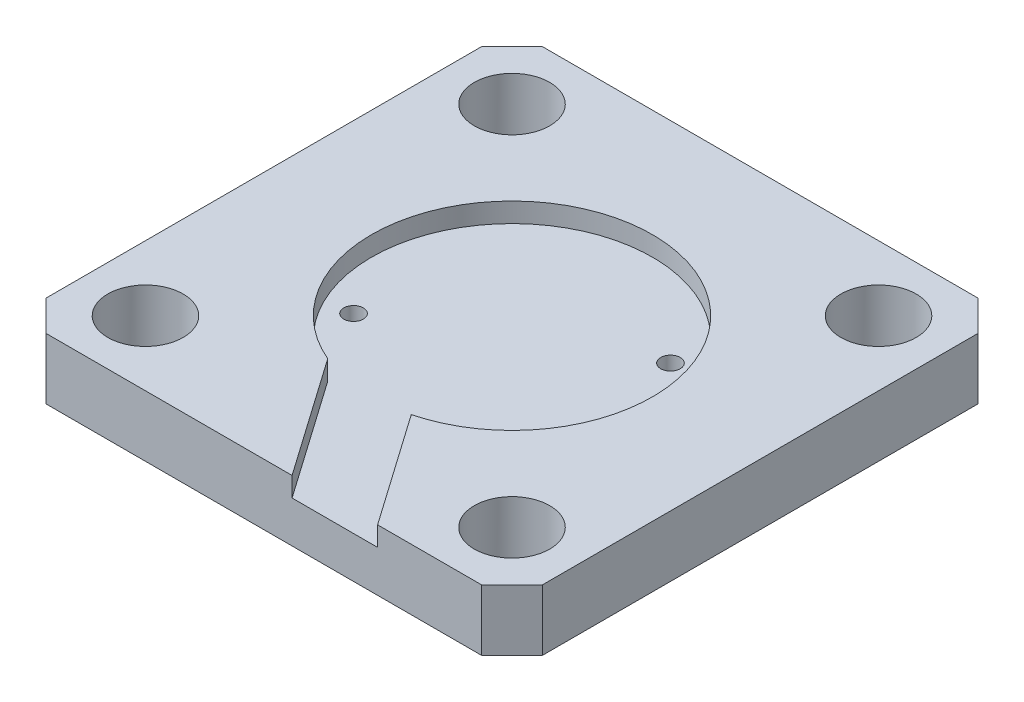
ISO-10303-21;
HEADER;
FILE_DESCRIPTION(('STEP AP214'),'2;1');
FILE_NAME('part.step','',(''),(''),'','','');
FILE_SCHEMA(('AUTOMOTIVE_DESIGN { 1 0 10303 214 1 1 1 1 }'));
ENDSEC;
DATA;
#1=APPLICATION_CONTEXT('core data for automotive mechanical design processes');
#2=APPLICATION_PROTOCOL_DEFINITION('international standard','automotive_design',2000,#1);
#3=PRODUCT_CONTEXT('',#1,'mechanical');
#4=PRODUCT('Part','Part','',(#3));
#5=PRODUCT_RELATED_PRODUCT_CATEGORY('part','',(#4));
#6=PRODUCT_DEFINITION_FORMATION('','',#4);
#7=PRODUCT_DEFINITION_CONTEXT('part definition',#1,'design');
#8=PRODUCT_DEFINITION('design','',#6,#7);
#9=PRODUCT_DEFINITION_SHAPE('','',#8);
#10=(LENGTH_UNIT() NAMED_UNIT(*) SI_UNIT(.MILLI.,.METRE.));
#11=(NAMED_UNIT(*) PLANE_ANGLE_UNIT() SI_UNIT($,.RADIAN.));
#12=(NAMED_UNIT(*) SI_UNIT($,.STERADIAN.) SOLID_ANGLE_UNIT());
#13=UNCERTAINTY_MEASURE_WITH_UNIT(LENGTH_MEASURE(1.E-05),#10,'distance_accuracy_value','');
#14=(GEOMETRIC_REPRESENTATION_CONTEXT(3) GLOBAL_UNCERTAINTY_ASSIGNED_CONTEXT((#13)) GLOBAL_UNIT_ASSIGNED_CONTEXT((#10,
#11,#12)) REPRESENTATION_CONTEXT('',''));
#15=CARTESIAN_POINT('',(0.,0.,0.));
#16=DIRECTION('',(0.,0.,1.));
#17=DIRECTION('',(1.,0.,0.));
#18=AXIS2_PLACEMENT_3D('',#15,#16,#17);
#19=CARTESIAN_POINT('',(-20.32,5.,20.32));
#20=DIRECTION('',(0.,0.,-1.));
#21=DIRECTION('',(-1.,0.,0.));
#22=AXIS2_PLACEMENT_3D('',#19,#20,#21);
#23=PLANE('',#22);
#24=DIRECTION('',(0.,1.,0.));
#25=VECTOR('',#24,1.);
#26=CARTESIAN_POINT('',(2.32,-13.5025136104955,20.32));
#27=LINE('',#26,#25);
#28=CARTESIAN_POINT('',(2.32,3.4,20.32));
#29=VERTEX_POINT('',#28);
#30=CARTESIAN_POINT('',(2.32,5.,20.32));
#31=VERTEX_POINT('',#30);
#32=EDGE_CURVE('E133',#29,#31,#27,.T.);
#33=ORIENTED_EDGE('',*,*,#32,.T.);
#34=DIRECTION('',(1.,0.,0.));
#35=VECTOR('',#34,1.);
#36=CARTESIAN_POINT('',(-20.32,5.,20.32));
#37=LINE('',#36,#35);
#38=CARTESIAN_POINT('',(-17.82,5.,20.32));
#39=VERTEX_POINT('',#38);
#40=EDGE_CURVE('E146',#39,#31,#37,.T.);
#41=ORIENTED_EDGE('',*,*,#40,.F.);
#42=DIRECTION('',(0.,-1.,0.));
#43=VECTOR('',#42,1.);
#44=CARTESIAN_POINT('',(-17.82,5.,20.32));
#45=LINE('',#44,#43);
#46=CARTESIAN_POINT('',(-17.82,0.,20.32));
#47=VERTEX_POINT('',#46);
#48=EDGE_CURVE('E161',#39,#47,#45,.T.);
#49=ORIENTED_EDGE('',*,*,#48,.T.);
#50=DIRECTION('',(1.,0.,0.));
#51=VECTOR('',#50,1.);
#52=CARTESIAN_POINT('',(-20.32,0.,20.32));
#53=LINE('',#52,#51);
#54=CARTESIAN_POINT('',(17.82,0.,20.32));
#55=VERTEX_POINT('',#54);
#56=EDGE_CURVE('E176',#47,#55,#53,.T.);
#57=ORIENTED_EDGE('',*,*,#56,.T.);
#58=DIRECTION('',(0.,1.,0.));
#59=VECTOR('',#58,1.);
#60=CARTESIAN_POINT('',(17.82,5.,20.32));
#61=LINE('',#60,#59);
#62=CARTESIAN_POINT('',(17.82,5.,20.32));
#63=VERTEX_POINT('',#62);
#64=EDGE_CURVE('E157',#55,#63,#61,.T.);
#65=ORIENTED_EDGE('',*,*,#64,.T.);
#66=CARTESIAN_POINT('',(9.32,5.,20.32));
#67=VERTEX_POINT('',#66);
#68=EDGE_CURVE('E158',#67,#63,#37,.T.);
#69=ORIENTED_EDGE('',*,*,#68,.F.);
#70=DIRECTION('',(0.,1.,0.));
#71=VECTOR('',#70,1.);
#72=CARTESIAN_POINT('',(9.32,-13.5025136104955,20.32));
#73=LINE('',#72,#71);
#74=CARTESIAN_POINT('',(9.32,3.39999999999999,20.32));
#75=VERTEX_POINT('',#74);
#76=EDGE_CURVE('E151',#75,#67,#73,.T.);
#77=ORIENTED_EDGE('',*,*,#76,.F.);
#78=DIRECTION('',(-1.,0.,0.));
#79=VECTOR('',#78,1.);
#80=CARTESIAN_POINT('',(0.,3.4,20.32));
#81=LINE('',#80,#79);
#82=EDGE_CURVE('E150',#75,#29,#81,.T.);
#83=ORIENTED_EDGE('',*,*,#82,.T.);
#84=EDGE_LOOP('',(#33,#41,#49,#57,#65,#69,#77,#83));
#85=FACE_BOUND('',#84,.T.);
#86=ADVANCED_FACE('F40',(#85),#23,.F.);
#87=CARTESIAN_POINT('',(0.,5.,0.));
#88=DIRECTION('',(0.,-1.,0.));
#89=DIRECTION('',(0.,0.,-1.));
#90=AXIS2_PLACEMENT_3D('',#87,#88,#89);
#91=PLANE('',#90);
#92=CARTESIAN_POINT('',(-15.,5.,-15.));
#93=DIRECTION('',(0.,1.,0.));
#94=DIRECTION('',(0.,0.,1.));
#95=AXIS2_PLACEMENT_3D('',#92,#93,#94);
#96=CIRCLE('',#95,3.085);
#97=CARTESIAN_POINT('',(-15.,5.,-11.915));
#98=VERTEX_POINT('',#97);
#99=EDGE_CURVE('E171',#98,#98,#96,.T.);
#100=ORIENTED_EDGE('',*,*,#99,.F.);
#101=EDGE_LOOP('',(#100));
#102=FACE_BOUND('',#101,.T.);
#103=CARTESIAN_POINT('',(15.,5.,-15.));
#104=DIRECTION('',(0.,1.,0.));
#105=DIRECTION('',(0.,0.,1.));
#106=AXIS2_PLACEMENT_3D('',#103,#104,#105);
#107=CIRCLE('',#106,3.085);
#108=CARTESIAN_POINT('',(15.,5.,-11.915));
#109=VERTEX_POINT('',#108);
#110=EDGE_CURVE('E246',#109,#109,#107,.T.);
#111=ORIENTED_EDGE('',*,*,#110,.F.);
#112=EDGE_LOOP('',(#111));
#113=FACE_BOUND('',#112,.T.);
#114=CARTESIAN_POINT('',(15.0000000000003,5.,15.));
#115=DIRECTION('',(0.,1.,0.));
#116=DIRECTION('',(0.,0.,1.));
#117=AXIS2_PLACEMENT_3D('',#114,#115,#116);
#118=CIRCLE('',#117,3.085);
#119=CARTESIAN_POINT('',(15.0000000000003,5.,18.085));
#120=VERTEX_POINT('',#119);
#121=EDGE_CURVE('E240',#120,#120,#118,.T.);
#122=ORIENTED_EDGE('',*,*,#121,.F.);
#123=EDGE_LOOP('',(#122));
#124=FACE_BOUND('',#123,.T.);
#125=CARTESIAN_POINT('',(-14.9999999999997,5.,15.));
#126=DIRECTION('',(0.,1.,0.));
#127=DIRECTION('',(0.,0.,1.));
#128=AXIS2_PLACEMENT_3D('',#125,#126,#127);
#129=CIRCLE('',#128,3.085);
#130=CARTESIAN_POINT('',(-14.9999999999997,5.,18.085));
#131=VERTEX_POINT('',#130);
#132=EDGE_CURVE('E233',#131,#131,#129,.T.);
#133=ORIENTED_EDGE('',*,*,#132,.F.);
#134=EDGE_LOOP('',(#133));
#135=FACE_BOUND('',#134,.T.);
#136=DIRECTION('',(-0.57357643635105,0.,-0.819152044288989));
#137=VECTOR('',#136,1.);
#138=CARTESIAN_POINT('',(-7.9905336609271,5.,5.59503190369964));
#139=LINE('',#138,#137);
#140=CARTESIAN_POINT('',(-4.49703455270138,5.,10.5842656916675));
#141=VERTEX_POINT('',#140);
#142=EDGE_CURVE('E130',#31,#141,#139,.T.);
#143=ORIENTED_EDGE('',*,*,#142,.T.);
#144=CARTESIAN_POINT('',(0.,5.,0.));
#145=DIRECTION('',(0.,1.,0.));
#146=DIRECTION('',(0.,0.,1.));
#147=AXIS2_PLACEMENT_3D('',#144,#145,#146);
#148=CIRCLE('',#147,11.5);
#149=CARTESIAN_POINT('',(2.8864061885103,5.,11.1318758219327));
#150=VERTEX_POINT('',#149);
#151=EDGE_CURVE('E251',#150,#141,#148,.T.);
#152=ORIENTED_EDGE('',*,*,#151,.F.);
#153=DIRECTION('',(-0.57357643635105,0.,-0.819152044288989));
#154=VECTOR('',#153,1.);
#155=CARTESIAN_POINT('',(-3.29346315928729,5.,2.30610773094895));
#156=LINE('',#155,#154);
#157=EDGE_CURVE('E141',#67,#150,#156,.T.);
#158=ORIENTED_EDGE('',*,*,#157,.F.);
#159=ORIENTED_EDGE('',*,*,#68,.T.);
#160=DIRECTION('',(-0.70710678118655,0.,0.707106781186546));
#161=VECTOR('',#160,1.);
#162=CARTESIAN_POINT('',(20.32,5.,17.82));
#163=LINE('',#162,#161);
#164=CARTESIAN_POINT('',(20.32,5.,17.82));
#165=VERTEX_POINT('',#164);
#166=EDGE_CURVE('E198',#63,#165,#163,.F.);
#167=ORIENTED_EDGE('',*,*,#166,.T.);
#168=DIRECTION('',(0.,0.,-1.));
#169=VECTOR('',#168,1.);
#170=CARTESIAN_POINT('',(20.32,5.,20.32));
#171=LINE('',#170,#169);
#172=CARTESIAN_POINT('',(20.32,5.,-17.82));
#173=VERTEX_POINT('',#172);
#174=EDGE_CURVE('E178',#165,#173,#171,.T.);
#175=ORIENTED_EDGE('',*,*,#174,.T.);
#176=DIRECTION('',(0.707106781186547,0.,0.707106781186548));
#177=VECTOR('',#176,1.);
#178=CARTESIAN_POINT('',(17.82,5.,-20.32));
#179=LINE('',#178,#177);
#180=CARTESIAN_POINT('',(17.82,5.,-20.32));
#181=VERTEX_POINT('',#180);
#182=EDGE_CURVE('E196',#173,#181,#179,.F.);
#183=ORIENTED_EDGE('',*,*,#182,.T.);
#184=DIRECTION('',(-1.,0.,0.));
#185=VECTOR('',#184,1.);
#186=CARTESIAN_POINT('',(-20.32,5.,-20.32));
#187=LINE('',#186,#185);
#188=CARTESIAN_POINT('',(-17.82,5.,-20.32));
#189=VERTEX_POINT('',#188);
#190=EDGE_CURVE('E223',#181,#189,#187,.T.);
#191=ORIENTED_EDGE('',*,*,#190,.T.);
#192=DIRECTION('',(0.707106781186548,0.,-0.707106781186547));
#193=VECTOR('',#192,1.);
#194=CARTESIAN_POINT('',(-20.32,5.,-17.82));
#195=LINE('',#194,#193);
#196=CARTESIAN_POINT('',(-20.32,5.,-17.82));
#197=VERTEX_POINT('',#196);
#198=EDGE_CURVE('E194',#189,#197,#195,.F.);
#199=ORIENTED_EDGE('',*,*,#198,.T.);
#200=DIRECTION('',(0.,0.,1.));
#201=VECTOR('',#200,1.);
#202=CARTESIAN_POINT('',(-20.32,5.,20.32));
#203=LINE('',#202,#201);
#204=CARTESIAN_POINT('',(-20.32,5.,17.82));
#205=VERTEX_POINT('',#204);
#206=EDGE_CURVE('E163',#197,#205,#203,.T.);
#207=ORIENTED_EDGE('',*,*,#206,.T.);
#208=DIRECTION('',(-0.707106781186546,0.,-0.70710678118655));
#209=VECTOR('',#208,1.);
#210=CARTESIAN_POINT('',(-17.82,5.,20.32));
#211=LINE('',#210,#209);
#212=EDGE_CURVE('E156',#205,#39,#211,.F.);
#213=ORIENTED_EDGE('',*,*,#212,.T.);
#214=ORIENTED_EDGE('',*,*,#40,.T.);
#215=EDGE_LOOP('',(#143,#152,#158,#159,#167,#175,#183,#191,#199,#207,#213,#214));
#216=FACE_BOUND('',#215,.T.);
#217=ADVANCED_FACE('F153',(#102,#113,#124,#135,#216),#91,.F.);
#218=CARTESIAN_POINT('',(0.,3.4,0.));
#219=DIRECTION('',(0.,1.,0.));
#220=DIRECTION('',(0.,0.,1.));
#221=AXIS2_PLACEMENT_3D('',#218,#219,#220);
#222=CYLINDRICAL_SURFACE('',#221,11.5);
#223=DIRECTION('',(0.,1.,0.));
#224=VECTOR('',#223,1.);
#225=CARTESIAN_POINT('',(-4.49703455270138,-13.5025136104955,10.5842656916675));
#226=LINE('',#225,#224);
#227=CARTESIAN_POINT('',(-4.49703455270138,3.4,10.5842656916675));
#228=VERTEX_POINT('',#227);
#229=EDGE_CURVE('E136',#228,#141,#226,.T.);
#230=ORIENTED_EDGE('',*,*,#229,.F.);
#231=CARTESIAN_POINT('',(0.,3.4,0.));
#232=DIRECTION('',(0.,1.,0.));
#233=DIRECTION('',(0.,0.,1.));
#234=AXIS2_PLACEMENT_3D('',#231,#232,#233);
#235=CIRCLE('',#234,11.5);
#236=CARTESIAN_POINT('',(2.8864061885103,3.4,11.1318758219327));
#237=VERTEX_POINT('',#236);
#238=EDGE_CURVE('E237',#237,#228,#235,.T.);
#239=ORIENTED_EDGE('',*,*,#238,.F.);
#240=DIRECTION('',(0.,1.,0.));
#241=VECTOR('',#240,1.);
#242=CARTESIAN_POINT('',(2.8864061885103,-13.5025136104955,11.1318758219327));
#243=LINE('',#242,#241);
#244=EDGE_CURVE('E55',#237,#150,#243,.T.);
#245=ORIENTED_EDGE('',*,*,#244,.T.);
#246=ORIENTED_EDGE('',*,*,#151,.T.);
#247=EDGE_LOOP('',(#230,#239,#245,#246));
#248=FACE_BOUND('',#247,.T.);
#249=ADVANCED_FACE('F283',(#248),#222,.F.);
#250=CARTESIAN_POINT('',(20.32,5.,20.32));
#251=DIRECTION('',(-1.,0.,0.));
#252=DIRECTION('',(0.,0.,1.));
#253=AXIS2_PLACEMENT_3D('',#250,#251,#252);
#254=PLANE('',#253);
#255=ORIENTED_EDGE('',*,*,#174,.F.);
#256=DIRECTION('',(0.,-1.,0.));
#257=VECTOR('',#256,1.);
#258=CARTESIAN_POINT('',(20.32,5.,17.82));
#259=LINE('',#258,#257);
#260=CARTESIAN_POINT('',(20.32,0.,17.82));
#261=VERTEX_POINT('',#260);
#262=EDGE_CURVE('E203',#165,#261,#259,.T.);
#263=ORIENTED_EDGE('',*,*,#262,.T.);
#264=DIRECTION('',(0.,0.,-1.));
#265=VECTOR('',#264,1.);
#266=CARTESIAN_POINT('',(20.32,0.,20.32));
#267=LINE('',#266,#265);
#268=CARTESIAN_POINT('',(20.32,0.,-17.82));
#269=VERTEX_POINT('',#268);
#270=EDGE_CURVE('E167',#261,#269,#267,.T.);
#271=ORIENTED_EDGE('',*,*,#270,.T.);
#272=DIRECTION('',(0.,1.,0.));
#273=VECTOR('',#272,1.);
#274=CARTESIAN_POINT('',(20.32,5.,-17.82));
#275=LINE('',#274,#273);
#276=EDGE_CURVE('E201',#269,#173,#275,.T.);
#277=ORIENTED_EDGE('',*,*,#276,.T.);
#278=EDGE_LOOP('',(#255,#263,#271,#277));
#279=FACE_BOUND('',#278,.T.);
#280=ADVANCED_FACE('F209',(#279),#254,.F.);
#281=CARTESIAN_POINT('',(-20.32,5.,-20.32));
#282=DIRECTION('',(0.,0.,1.));
#283=DIRECTION('',(1.,0.,0.));
#284=AXIS2_PLACEMENT_3D('',#281,#282,#283);
#285=PLANE('',#284);
#286=ORIENTED_EDGE('',*,*,#190,.F.);
#287=DIRECTION('',(0.,-1.,0.));
#288=VECTOR('',#287,1.);
#289=CARTESIAN_POINT('',(17.82,5.,-20.32));
#290=LINE('',#289,#288);
#291=CARTESIAN_POINT('',(17.82,0.,-20.32));
#292=VERTEX_POINT('',#291);
#293=EDGE_CURVE('E12',#181,#292,#290,.T.);
#294=ORIENTED_EDGE('',*,*,#293,.T.);
#295=DIRECTION('',(-1.,0.,0.));
#296=VECTOR('',#295,1.);
#297=CARTESIAN_POINT('',(-20.32,0.,-20.32));
#298=LINE('',#297,#296);
#299=CARTESIAN_POINT('',(-17.82,0.,-20.32));
#300=VERTEX_POINT('',#299);
#301=EDGE_CURVE('E170',#292,#300,#298,.T.);
#302=ORIENTED_EDGE('',*,*,#301,.T.);
#303=DIRECTION('',(0.,1.,0.));
#304=VECTOR('',#303,1.);
#305=CARTESIAN_POINT('',(-17.82,5.,-20.32));
#306=LINE('',#305,#304);
#307=EDGE_CURVE('E48',#300,#189,#306,.T.);
#308=ORIENTED_EDGE('',*,*,#307,.T.);
#309=EDGE_LOOP('',(#286,#294,#302,#308));
#310=FACE_BOUND('',#309,.T.);
#311=ADVANCED_FACE('F222',(#310),#285,.F.);
#312=CARTESIAN_POINT('',(-20.32,5.,20.32));
#313=DIRECTION('',(1.,0.,0.));
#314=DIRECTION('',(0.,0.,-1.));
#315=AXIS2_PLACEMENT_3D('',#312,#313,#314);
#316=PLANE('',#315);
#317=DIRECTION('',(0.,0.,1.));
#318=VECTOR('',#317,1.);
#319=CARTESIAN_POINT('',(-20.32,0.,20.32));
#320=LINE('',#319,#318);
#321=CARTESIAN_POINT('',(-20.32,0.,-17.82));
#322=VERTEX_POINT('',#321);
#323=CARTESIAN_POINT('',(-20.32,0.,17.82));
#324=VERTEX_POINT('',#323);
#325=EDGE_CURVE('E173',#322,#324,#320,.T.);
#326=ORIENTED_EDGE('',*,*,#325,.T.);
#327=DIRECTION('',(0.,1.,0.));
#328=VECTOR('',#327,1.);
#329=CARTESIAN_POINT('',(-20.32,5.,17.82));
#330=LINE('',#329,#328);
#331=EDGE_CURVE('E192',#324,#205,#330,.T.);
#332=ORIENTED_EDGE('',*,*,#331,.T.);
#333=ORIENTED_EDGE('',*,*,#206,.F.);
#334=DIRECTION('',(0.,-1.,0.));
#335=VECTOR('',#334,1.);
#336=CARTESIAN_POINT('',(-20.32,5.,-17.82));
#337=LINE('',#336,#335);
#338=EDGE_CURVE('E189',#197,#322,#337,.T.);
#339=ORIENTED_EDGE('',*,*,#338,.T.);
#340=EDGE_LOOP('',(#326,#332,#333,#339));
#341=FACE_BOUND('',#340,.T.);
#342=ADVANCED_FACE('F301',(#341),#316,.F.);
#343=CARTESIAN_POINT('',(0.,0.,0.));
#344=DIRECTION('',(0.,-1.,0.));
#345=DIRECTION('',(0.,0.,-1.));
#346=AXIS2_PLACEMENT_3D('',#343,#344,#345);
#347=PLANE('',#346);
#348=CARTESIAN_POINT('',(-8.24305369582557,0.,4.72730916659133));
#349=DIRECTION('',(0.,1.,0.));
#350=DIRECTION('',(0.,0.,1.));
#351=AXIS2_PLACEMENT_3D('',#348,#349,#350);
#352=CIRCLE('',#351,0.800000000000001);
#353=CARTESIAN_POINT('',(-8.24305369582557,0.,5.52730916659133));
#354=VERTEX_POINT('',#353);
#355=EDGE_CURVE('E253',#354,#354,#352,.T.);
#356=ORIENTED_EDGE('',*,*,#355,.T.);
#357=EDGE_LOOP('',(#356));
#358=FACE_BOUND('',#357,.T.);
#359=CARTESIAN_POINT('',(8.24305369582557,0.,-4.72730916659133));
#360=DIRECTION('',(0.,1.,0.));
#361=DIRECTION('',(0.,0.,1.));
#362=AXIS2_PLACEMENT_3D('',#359,#360,#361);
#363=CIRCLE('',#362,0.800000000000001);
#364=CARTESIAN_POINT('',(8.24305369582557,0.,-3.92730916659133));
#365=VERTEX_POINT('',#364);
#366=EDGE_CURVE('E256',#365,#365,#363,.T.);
#367=ORIENTED_EDGE('',*,*,#366,.T.);
#368=EDGE_LOOP('',(#367));
#369=FACE_BOUND('',#368,.T.);
#370=CARTESIAN_POINT('',(-14.9999999999997,0.,15.));
#371=DIRECTION('',(0.,-1.,0.));
#372=DIRECTION('',(0.,0.,-1.));
#373=AXIS2_PLACEMENT_3D('',#370,#371,#372);
#374=CIRCLE('',#373,3.085);
#375=CARTESIAN_POINT('',(-14.9999999999997,0.,11.915));
#376=VERTEX_POINT('',#375);
#377=EDGE_CURVE('E236',#376,#376,#374,.F.);
#378=ORIENTED_EDGE('',*,*,#377,.T.);
#379=EDGE_LOOP('',(#378));
#380=FACE_BOUND('',#379,.T.);
#381=CARTESIAN_POINT('',(15.0000000000003,0.,15.));
#382=DIRECTION('',(0.,-1.,0.));
#383=DIRECTION('',(0.,0.,-1.));
#384=AXIS2_PLACEMENT_3D('',#381,#382,#383);
#385=CIRCLE('',#384,3.085);
#386=CARTESIAN_POINT('',(15.0000000000003,0.,11.915));
#387=VERTEX_POINT('',#386);
#388=EDGE_CURVE('E243',#387,#387,#385,.F.);
#389=ORIENTED_EDGE('',*,*,#388,.T.);
#390=EDGE_LOOP('',(#389));
#391=FACE_BOUND('',#390,.T.);
#392=CARTESIAN_POINT('',(15.,0.,-15.));
#393=DIRECTION('',(0.,-1.,0.));
#394=DIRECTION('',(0.,0.,-1.));
#395=AXIS2_PLACEMENT_3D('',#392,#393,#394);
#396=CIRCLE('',#395,3.085);
#397=CARTESIAN_POINT('',(15.,0.,-18.085));
#398=VERTEX_POINT('',#397);
#399=EDGE_CURVE('E230',#398,#398,#396,.F.);
#400=ORIENTED_EDGE('',*,*,#399,.T.);
#401=EDGE_LOOP('',(#400));
#402=FACE_BOUND('',#401,.T.);
#403=CARTESIAN_POINT('',(-15.,0.,-15.));
#404=DIRECTION('',(0.,-1.,0.));
#405=DIRECTION('',(0.,0.,-1.));
#406=AXIS2_PLACEMENT_3D('',#403,#404,#405);
#407=CIRCLE('',#406,3.085);
#408=CARTESIAN_POINT('',(-15.,0.,-18.085));
#409=VERTEX_POINT('',#408);
#410=EDGE_CURVE('E227',#409,#409,#407,.F.);
#411=ORIENTED_EDGE('',*,*,#410,.T.);
#412=EDGE_LOOP('',(#411));
#413=FACE_BOUND('',#412,.T.);
#414=ORIENTED_EDGE('',*,*,#56,.F.);
#415=DIRECTION('',(0.707106781186546,0.,0.70710678118655));
#416=VECTOR('',#415,1.);
#417=CARTESIAN_POINT('',(-19.0700000000001,0.,19.07));
#418=LINE('',#417,#416);
#419=EDGE_CURVE('E187',#47,#324,#418,.F.);
#420=ORIENTED_EDGE('',*,*,#419,.T.);
#421=ORIENTED_EDGE('',*,*,#325,.F.);
#422=DIRECTION('',(-0.707106781186548,0.,0.707106781186547));
#423=VECTOR('',#422,1.);
#424=CARTESIAN_POINT('',(-19.07,0.,-19.07));
#425=LINE('',#424,#423);
#426=EDGE_CURVE('E181',#322,#300,#425,.F.);
#427=ORIENTED_EDGE('',*,*,#426,.T.);
#428=ORIENTED_EDGE('',*,*,#301,.F.);
#429=DIRECTION('',(-0.707106781186547,0.,-0.707106781186548));
#430=VECTOR('',#429,1.);
#431=CARTESIAN_POINT('',(19.07,0.,-19.07));
#432=LINE('',#431,#430);
#433=EDGE_CURVE('E183',#292,#269,#432,.F.);
#434=ORIENTED_EDGE('',*,*,#433,.T.);
#435=ORIENTED_EDGE('',*,*,#270,.F.);
#436=DIRECTION('',(0.70710678118655,0.,-0.707106781186546));
#437=VECTOR('',#436,1.);
#438=CARTESIAN_POINT('',(19.0699999999999,0.,19.0700000000001));
#439=LINE('',#438,#437);
#440=EDGE_CURVE('E185',#261,#55,#439,.F.);
#441=ORIENTED_EDGE('',*,*,#440,.T.);
#442=EDGE_LOOP('',(#414,#420,#421,#427,#428,#434,#435,#441));
#443=FACE_BOUND('',#442,.T.);
#444=ADVANCED_FACE('F216',(#358,#369,#380,#391,#402,#413,#443),#347,.T.);
#445=CARTESIAN_POINT('',(-15.,-0.00100000000000013,-15.));
#446=DIRECTION('',(0.,1.,0.));
#447=DIRECTION('',(0.,0.,1.));
#448=AXIS2_PLACEMENT_3D('',#445,#446,#447);
#449=CYLINDRICAL_SURFACE('',#448,3.085);
#450=ORIENTED_EDGE('',*,*,#410,.F.);
#451=EDGE_LOOP('',(#450));
#452=FACE_BOUND('',#451,.T.);
#453=ORIENTED_EDGE('',*,*,#99,.T.);
#454=EDGE_LOOP('',(#453));
#455=FACE_BOUND('',#454,.T.);
#456=ADVANCED_FACE('F366',(#452,#455),#449,.F.);
#457=CARTESIAN_POINT('',(15.,-0.00100000000000013,-15.));
#458=DIRECTION('',(0.,1.,0.));
#459=DIRECTION('',(0.,0.,1.));
#460=AXIS2_PLACEMENT_3D('',#457,#458,#459);
#461=CYLINDRICAL_SURFACE('',#460,3.085);
#462=ORIENTED_EDGE('',*,*,#399,.F.);
#463=EDGE_LOOP('',(#462));
#464=FACE_BOUND('',#463,.T.);
#465=ORIENTED_EDGE('',*,*,#110,.T.);
#466=EDGE_LOOP('',(#465));
#467=FACE_BOUND('',#466,.T.);
#468=ADVANCED_FACE('F427',(#464,#467),#461,.F.);
#469=CARTESIAN_POINT('',(15.0000000000003,-0.00100000000000013,15.));
#470=DIRECTION('',(0.,1.,0.));
#471=DIRECTION('',(0.,0.,1.));
#472=AXIS2_PLACEMENT_3D('',#469,#470,#471);
#473=CYLINDRICAL_SURFACE('',#472,3.085);
#474=ORIENTED_EDGE('',*,*,#388,.F.);
#475=EDGE_LOOP('',(#474));
#476=FACE_BOUND('',#475,.T.);
#477=ORIENTED_EDGE('',*,*,#121,.T.);
#478=EDGE_LOOP('',(#477));
#479=FACE_BOUND('',#478,.T.);
#480=ADVANCED_FACE('F417',(#476,#479),#473,.F.);
#481=CARTESIAN_POINT('',(-14.9999999999997,-0.00100000000000013,15.));
#482=DIRECTION('',(0.,1.,0.));
#483=DIRECTION('',(0.,0.,1.));
#484=AXIS2_PLACEMENT_3D('',#481,#482,#483);
#485=CYLINDRICAL_SURFACE('',#484,3.085);
#486=ORIENTED_EDGE('',*,*,#377,.F.);
#487=EDGE_LOOP('',(#486));
#488=FACE_BOUND('',#487,.T.);
#489=ORIENTED_EDGE('',*,*,#132,.T.);
#490=EDGE_LOOP('',(#489));
#491=FACE_BOUND('',#490,.T.);
#492=ADVANCED_FACE('F311',(#488,#491),#485,.F.);
#493=CARTESIAN_POINT('',(-17.82,5.,20.32));
#494=DIRECTION('',(0.707106781186549,0.,-0.707106781186545));
#495=DIRECTION('',(0.,-1.,0.));
#496=AXIS2_PLACEMENT_3D('',#493,#494,#495);
#497=PLANE('',#496);
#498=ORIENTED_EDGE('',*,*,#212,.F.);
#499=ORIENTED_EDGE('',*,*,#331,.F.);
#500=ORIENTED_EDGE('',*,*,#419,.F.);
#501=ORIENTED_EDGE('',*,*,#48,.F.);
#502=EDGE_LOOP('',(#498,#499,#500,#501));
#503=FACE_BOUND('',#502,.T.);
#504=ADVANCED_FACE('F307',(#503),#497,.F.);
#505=CARTESIAN_POINT('',(20.32,5.,17.82));
#506=DIRECTION('',(-0.707106781186545,0.,-0.707106781186549));
#507=DIRECTION('',(0.,-1.,0.));
#508=AXIS2_PLACEMENT_3D('',#505,#506,#507);
#509=PLANE('',#508);
#510=ORIENTED_EDGE('',*,*,#166,.F.);
#511=ORIENTED_EDGE('',*,*,#64,.F.);
#512=ORIENTED_EDGE('',*,*,#440,.F.);
#513=ORIENTED_EDGE('',*,*,#262,.F.);
#514=EDGE_LOOP('',(#510,#511,#512,#513));
#515=FACE_BOUND('',#514,.T.);
#516=ADVANCED_FACE('F310',(#515),#509,.F.);
#517=CARTESIAN_POINT('',(17.82,5.,-20.32));
#518=DIRECTION('',(-0.707106781186548,0.,0.707106781186547));
#519=DIRECTION('',(0.,-1.,0.));
#520=AXIS2_PLACEMENT_3D('',#517,#518,#519);
#521=PLANE('',#520);
#522=ORIENTED_EDGE('',*,*,#182,.F.);
#523=ORIENTED_EDGE('',*,*,#276,.F.);
#524=ORIENTED_EDGE('',*,*,#433,.F.);
#525=ORIENTED_EDGE('',*,*,#293,.F.);
#526=EDGE_LOOP('',(#522,#523,#524,#525));
#527=FACE_BOUND('',#526,.T.);
#528=ADVANCED_FACE('F221',(#527),#521,.F.);
#529=CARTESIAN_POINT('',(-20.32,5.,-17.82));
#530=DIRECTION('',(0.707106781186547,0.,0.707106781186548));
#531=DIRECTION('',(0.,-1.,0.));
#532=AXIS2_PLACEMENT_3D('',#529,#530,#531);
#533=PLANE('',#532);
#534=ORIENTED_EDGE('',*,*,#198,.F.);
#535=ORIENTED_EDGE('',*,*,#307,.F.);
#536=ORIENTED_EDGE('',*,*,#426,.F.);
#537=ORIENTED_EDGE('',*,*,#338,.F.);
#538=EDGE_LOOP('',(#534,#535,#536,#537));
#539=FACE_BOUND('',#538,.T.);
#540=ADVANCED_FACE('F42',(#539),#533,.F.);
#541=CARTESIAN_POINT('',(0.,3.4,0.));
#542=DIRECTION('',(0.,1.,0.));
#543=DIRECTION('',(0.,0.,1.));
#544=AXIS2_PLACEMENT_3D('',#541,#542,#543);
#545=PLANE('',#544);
#546=CARTESIAN_POINT('',(-8.24305369582557,3.4,4.72730916659133));
#547=DIRECTION('',(0.,1.,0.));
#548=DIRECTION('',(0.,0.,1.));
#549=AXIS2_PLACEMENT_3D('',#546,#547,#548);
#550=CIRCLE('',#549,0.800000000000001);
#551=CARTESIAN_POINT('',(-8.24305369582557,3.4,5.52730916659133));
#552=VERTEX_POINT('',#551);
#553=EDGE_CURVE('E262',#552,#552,#550,.T.);
#554=ORIENTED_EDGE('',*,*,#553,.F.);
#555=EDGE_LOOP('',(#554));
#556=FACE_BOUND('',#555,.T.);
#557=CARTESIAN_POINT('',(8.24305369582557,3.4,-4.72730916659133));
#558=DIRECTION('',(0.,1.,0.));
#559=DIRECTION('',(0.,0.,1.));
#560=AXIS2_PLACEMENT_3D('',#557,#558,#559);
#561=CIRCLE('',#560,0.800000000000001);
#562=CARTESIAN_POINT('',(8.24305369582557,3.4,-3.92730916659133));
#563=VERTEX_POINT('',#562);
#564=EDGE_CURVE('E259',#563,#563,#561,.T.);
#565=ORIENTED_EDGE('',*,*,#564,.F.);
#566=EDGE_LOOP('',(#565));
#567=FACE_BOUND('',#566,.T.);
#568=ORIENTED_EDGE('',*,*,#238,.T.);
#569=DIRECTION('',(0.57357643635105,0.,0.819152044288989));
#570=VECTOR('',#569,1.);
#571=CARTESIAN_POINT('',(-7.9905336609271,3.4,5.59503190369964));
#572=LINE('',#571,#570);
#573=EDGE_CURVE('E267',#228,#29,#572,.T.);
#574=ORIENTED_EDGE('',*,*,#573,.T.);
#575=ORIENTED_EDGE('',*,*,#82,.F.);
#576=DIRECTION('',(0.57357643635105,0.,0.819152044288989));
#577=VECTOR('',#576,1.);
#578=CARTESIAN_POINT('',(-3.29346315928729,3.4,2.30610773094895));
#579=LINE('',#578,#577);
#580=EDGE_CURVE('E272',#237,#75,#579,.T.);
#581=ORIENTED_EDGE('',*,*,#580,.F.);
#582=EDGE_LOOP('',(#568,#574,#575,#581));
#583=FACE_BOUND('',#582,.T.);
#584=ADVANCED_FACE('F279',(#556,#567,#583),#545,.T.);
#585=CARTESIAN_POINT('',(8.24305369582557,0.,-4.72730916659133));
#586=DIRECTION('',(0.,1.,0.));
#587=DIRECTION('',(0.,0.,1.));
#588=AXIS2_PLACEMENT_3D('',#585,#586,#587);
#589=CYLINDRICAL_SURFACE('',#588,0.800000000000001);
#590=ORIENTED_EDGE('',*,*,#366,.F.);
#591=EDGE_LOOP('',(#590));
#592=FACE_BOUND('',#591,.T.);
#593=ORIENTED_EDGE('',*,*,#564,.T.);
#594=EDGE_LOOP('',(#593));
#595=FACE_BOUND('',#594,.T.);
#596=ADVANCED_FACE('F322',(#592,#595),#589,.F.);
#597=CARTESIAN_POINT('',(-8.24305369582557,0.,4.72730916659133));
#598=DIRECTION('',(0.,1.,0.));
#599=DIRECTION('',(0.,0.,1.));
#600=AXIS2_PLACEMENT_3D('',#597,#598,#599);
#601=CYLINDRICAL_SURFACE('',#600,0.800000000000001);
#602=ORIENTED_EDGE('',*,*,#355,.F.);
#603=EDGE_LOOP('',(#602));
#604=FACE_BOUND('',#603,.T.);
#605=ORIENTED_EDGE('',*,*,#553,.T.);
#606=EDGE_LOOP('',(#605));
#607=FACE_BOUND('',#606,.T.);
#608=ADVANCED_FACE('F331',(#604,#607),#601,.F.);
#609=CARTESIAN_POINT('',(-7.9905336609271,-13.5025136104955,5.59503190369964));
#610=DIRECTION('',(0.819152044288989,0.,-0.57357643635105));
#611=DIRECTION('',(-0.57357643635105,0.,-0.819152044288989));
#612=AXIS2_PLACEMENT_3D('',#609,#610,#611);
#613=PLANE('',#612);
#614=ORIENTED_EDGE('',*,*,#229,.T.);
#615=ORIENTED_EDGE('',*,*,#142,.F.);
#616=ORIENTED_EDGE('',*,*,#32,.F.);
#617=ORIENTED_EDGE('',*,*,#573,.F.);
#618=EDGE_LOOP('',(#614,#615,#616,#617));
#619=FACE_BOUND('',#618,.T.);
#620=ADVANCED_FACE('F132',(#619),#613,.T.);
#621=CARTESIAN_POINT('',(-3.29346315928729,-13.5025136104955,2.30610773094895));
#622=DIRECTION('',(0.819152044288989,0.,-0.57357643635105));
#623=DIRECTION('',(-0.57357643635105,0.,-0.819152044288989));
#624=AXIS2_PLACEMENT_3D('',#621,#622,#623);
#625=PLANE('',#624);
#626=ORIENTED_EDGE('',*,*,#580,.T.);
#627=ORIENTED_EDGE('',*,*,#76,.T.);
#628=ORIENTED_EDGE('',*,*,#157,.T.);
#629=ORIENTED_EDGE('',*,*,#244,.F.);
#630=EDGE_LOOP('',(#626,#627,#628,#629));
#631=FACE_BOUND('',#630,.T.);
#632=ADVANCED_FACE('F275',(#631),#625,.F.);
#633=CLOSED_SHELL('',(#86,#217,#249,#280,#311,#342,#444,#456,#468,#480,#492,#504,#516,#528,#540,
#584,#596,#608,#620,#632));
#634=MANIFOLD_SOLID_BREP('B2',#633);
#635=ADVANCED_BREP_SHAPE_REPRESENTATION('',(#18,#634),#14);
#636=SHAPE_DEFINITION_REPRESENTATION(#9,#635);
ENDSEC;
END-ISO-10303-21;
